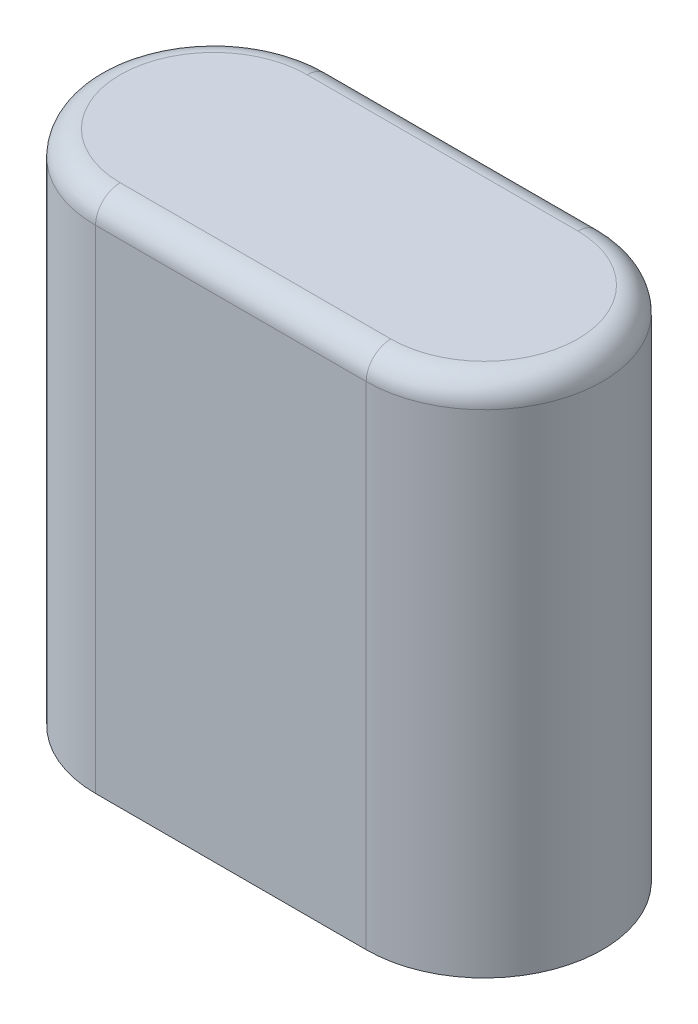
ISO-10303-21;
HEADER;
FILE_DESCRIPTION(('STEP AP214'),'2;1');
FILE_NAME('part.step','',(''),(''),'','','');
FILE_SCHEMA(('AUTOMOTIVE_DESIGN { 1 0 10303 214 1 1 1 1 }'));
ENDSEC;
DATA;
#1=APPLICATION_CONTEXT('core data for automotive mechanical design processes');
#2=APPLICATION_PROTOCOL_DEFINITION('international standard','automotive_design',2000,#1);
#3=PRODUCT_CONTEXT('',#1,'mechanical');
#4=PRODUCT('Part','Part','',(#3));
#5=PRODUCT_RELATED_PRODUCT_CATEGORY('part','',(#4));
#6=PRODUCT_DEFINITION_FORMATION('','',#4);
#7=PRODUCT_DEFINITION_CONTEXT('part definition',#1,'design');
#8=PRODUCT_DEFINITION('design','',#6,#7);
#9=PRODUCT_DEFINITION_SHAPE('','',#8);
#10=(LENGTH_UNIT() NAMED_UNIT(*) SI_UNIT(.MILLI.,.METRE.));
#11=(NAMED_UNIT(*) PLANE_ANGLE_UNIT() SI_UNIT($,.RADIAN.));
#12=(NAMED_UNIT(*) SI_UNIT($,.STERADIAN.) SOLID_ANGLE_UNIT());
#13=UNCERTAINTY_MEASURE_WITH_UNIT(LENGTH_MEASURE(1.E-05),#10,'distance_accuracy_value','');
#14=(GEOMETRIC_REPRESENTATION_CONTEXT(3) GLOBAL_UNCERTAINTY_ASSIGNED_CONTEXT((#13)) GLOBAL_UNIT_ASSIGNED_CONTEXT((#10,
#11,#12)) REPRESENTATION_CONTEXT('',''));
#15=CARTESIAN_POINT('',(0.,0.,0.));
#16=DIRECTION('',(0.,0.,1.));
#17=DIRECTION('',(1.,0.,0.));
#18=AXIS2_PLACEMENT_3D('',#15,#16,#17);
#19=CARTESIAN_POINT('',(-3.4925,13.335,0.));
#20=DIRECTION('',(0.,-1.,0.));
#21=DIRECTION('',(0.,0.,-1.));
#22=AXIS2_PLACEMENT_3D('',#19,#20,#21);
#23=CYLINDRICAL_SURFACE('',#22,3.048);
#24=DIRECTION('',(0.,-1.,0.));
#25=VECTOR('',#24,1.);
#26=CARTESIAN_POINT('',(-3.4925,13.335,3.048));
#27=LINE('',#26,#25);
#28=CARTESIAN_POINT('',(-3.4925,12.7,3.048));
#29=VERTEX_POINT('',#28);
#30=CARTESIAN_POINT('',(-3.4925,0.,3.048));
#31=VERTEX_POINT('',#30);
#32=EDGE_CURVE('E94',#29,#31,#27,.T.);
#33=ORIENTED_EDGE('',*,*,#32,.F.);
#34=CARTESIAN_POINT('',(-3.4925,12.7,0.));
#35=DIRECTION('',(0.,1.,0.));
#36=DIRECTION('',(0.,0.,1.));
#37=AXIS2_PLACEMENT_3D('',#34,#35,#36);
#38=CIRCLE('',#37,3.048);
#39=CARTESIAN_POINT('',(-3.4925,12.7,-3.048));
#40=VERTEX_POINT('',#39);
#41=EDGE_CURVE('E64',#29,#40,#38,.F.);
#42=ORIENTED_EDGE('',*,*,#41,.T.);
#43=DIRECTION('',(0.,-1.,0.));
#44=VECTOR('',#43,1.);
#45=CARTESIAN_POINT('',(-3.4925,13.335,-3.048));
#46=LINE('',#45,#44);
#47=CARTESIAN_POINT('',(-3.4925,0.,-3.048));
#48=VERTEX_POINT('',#47);
#49=EDGE_CURVE('E116',#40,#48,#46,.T.);
#50=ORIENTED_EDGE('',*,*,#49,.T.);
#51=CARTESIAN_POINT('',(-3.4925,0.,0.));
#52=DIRECTION('',(0.,1.,0.));
#53=DIRECTION('',(0.,0.,1.));
#54=AXIS2_PLACEMENT_3D('',#51,#52,#53);
#55=CIRCLE('',#54,3.048);
#56=EDGE_CURVE('E111',#48,#31,#55,.T.);
#57=ORIENTED_EDGE('',*,*,#56,.T.);
#58=EDGE_LOOP('',(#33,#42,#50,#57));
#59=FACE_BOUND('',#58,.T.);
#60=ADVANCED_FACE('F39',(#59),#23,.T.);
#61=CARTESIAN_POINT('',(-3.4925,13.335,3.048));
#62=DIRECTION('',(0.,0.,-1.));
#63=DIRECTION('',(-1.,0.,0.));
#64=AXIS2_PLACEMENT_3D('',#61,#62,#63);
#65=PLANE('',#64);
#66=DIRECTION('',(0.,-1.,0.));
#67=VECTOR('',#66,1.);
#68=CARTESIAN_POINT('',(3.4925,13.335,3.048));
#69=LINE('',#68,#67);
#70=CARTESIAN_POINT('',(3.4925,12.7,3.048));
#71=VERTEX_POINT('',#70);
#72=CARTESIAN_POINT('',(3.4925,0.,3.048));
#73=VERTEX_POINT('',#72);
#74=EDGE_CURVE('E105',#71,#73,#69,.T.);
#75=ORIENTED_EDGE('',*,*,#74,.F.);
#76=DIRECTION('',(1.,0.,0.));
#77=VECTOR('',#76,1.);
#78=CARTESIAN_POINT('',(-3.4925,12.7,3.048));
#79=LINE('',#78,#77);
#80=EDGE_CURVE('E101',#71,#29,#79,.F.);
#81=ORIENTED_EDGE('',*,*,#80,.T.);
#82=ORIENTED_EDGE('',*,*,#32,.T.);
#83=DIRECTION('',(1.,0.,0.));
#84=VECTOR('',#83,1.);
#85=CARTESIAN_POINT('',(-3.4925,0.,3.048));
#86=LINE('',#85,#84);
#87=EDGE_CURVE('E98',#31,#73,#86,.T.);
#88=ORIENTED_EDGE('',*,*,#87,.T.);
#89=EDGE_LOOP('',(#75,#81,#82,#88));
#90=FACE_BOUND('',#89,.T.);
#91=ADVANCED_FACE('F97',(#90),#65,.F.);
#92=CARTESIAN_POINT('',(3.4925,13.335,0.));
#93=DIRECTION('',(0.,-1.,0.));
#94=DIRECTION('',(0.,0.,-1.));
#95=AXIS2_PLACEMENT_3D('',#92,#93,#94);
#96=CYLINDRICAL_SURFACE('',#95,3.048);
#97=DIRECTION('',(0.,-1.,0.));
#98=VECTOR('',#97,1.);
#99=CARTESIAN_POINT('',(3.4925,13.335,-3.048));
#100=LINE('',#99,#98);
#101=CARTESIAN_POINT('',(3.4925,12.7,-3.048));
#102=VERTEX_POINT('',#101);
#103=CARTESIAN_POINT('',(3.4925,0.,-3.048));
#104=VERTEX_POINT('',#103);
#105=EDGE_CURVE('E134',#102,#104,#100,.T.);
#106=ORIENTED_EDGE('',*,*,#105,.F.);
#107=CARTESIAN_POINT('',(3.4925,12.7,0.));
#108=DIRECTION('',(0.,1.,0.));
#109=DIRECTION('',(0.,0.,1.));
#110=AXIS2_PLACEMENT_3D('',#107,#108,#109);
#111=CIRCLE('',#110,3.048);
#112=EDGE_CURVE('E11',#102,#71,#111,.F.);
#113=ORIENTED_EDGE('',*,*,#112,.T.);
#114=ORIENTED_EDGE('',*,*,#74,.T.);
#115=CARTESIAN_POINT('',(3.4925,0.,0.));
#116=DIRECTION('',(0.,1.,0.));
#117=DIRECTION('',(0.,0.,1.));
#118=AXIS2_PLACEMENT_3D('',#115,#116,#117);
#119=CIRCLE('',#118,3.048);
#120=EDGE_CURVE('E113',#73,#104,#119,.T.);
#121=ORIENTED_EDGE('',*,*,#120,.T.);
#122=EDGE_LOOP('',(#106,#113,#114,#121));
#123=FACE_BOUND('',#122,.T.);
#124=ADVANCED_FACE('F194',(#123),#96,.T.);
#125=CARTESIAN_POINT('',(-3.4925,13.335,-3.048));
#126=DIRECTION('',(0.,0.,1.));
#127=DIRECTION('',(1.,0.,0.));
#128=AXIS2_PLACEMENT_3D('',#125,#126,#127);
#129=PLANE('',#128);
#130=ORIENTED_EDGE('',*,*,#49,.F.);
#131=DIRECTION('',(-1.,0.,0.));
#132=VECTOR('',#131,1.);
#133=CARTESIAN_POINT('',(3.4925,12.7,-3.048));
#134=LINE('',#133,#132);
#135=EDGE_CURVE('E49',#40,#102,#134,.F.);
#136=ORIENTED_EDGE('',*,*,#135,.T.);
#137=ORIENTED_EDGE('',*,*,#105,.T.);
#138=DIRECTION('',(-1.,0.,0.));
#139=VECTOR('',#138,1.);
#140=CARTESIAN_POINT('',(-3.4925,0.,-3.048));
#141=LINE('',#140,#139);
#142=EDGE_CURVE('E129',#104,#48,#141,.T.);
#143=ORIENTED_EDGE('',*,*,#142,.T.);
#144=EDGE_LOOP('',(#130,#136,#137,#143));
#145=FACE_BOUND('',#144,.T.);
#146=ADVANCED_FACE('F216',(#145),#129,.F.);
#147=CARTESIAN_POINT('',(-3.4925,13.335,0.));
#148=DIRECTION('',(0.,1.,0.));
#149=DIRECTION('',(0.,0.,1.));
#150=AXIS2_PLACEMENT_3D('',#147,#148,#149);
#151=PLANE('',#150);
#152=CARTESIAN_POINT('',(-3.4925,13.335,0.));
#153=DIRECTION('',(0.,1.,0.));
#154=DIRECTION('',(0.,0.,1.));
#155=AXIS2_PLACEMENT_3D('',#152,#153,#154);
#156=CIRCLE('',#155,2.413);
#157=CARTESIAN_POINT('',(-3.4925,13.335,-2.413));
#158=VERTEX_POINT('',#157);
#159=CARTESIAN_POINT('',(-3.4925,13.335,2.413));
#160=VERTEX_POINT('',#159);
#161=EDGE_CURVE('E144',#158,#160,#156,.T.);
#162=ORIENTED_EDGE('',*,*,#161,.T.);
#163=DIRECTION('',(1.,0.,0.));
#164=VECTOR('',#163,1.);
#165=CARTESIAN_POINT('',(3.4925,13.335,2.413));
#166=LINE('',#165,#164);
#167=CARTESIAN_POINT('',(3.4925,13.335,2.413));
#168=VERTEX_POINT('',#167);
#169=EDGE_CURVE('E147',#160,#168,#166,.T.);
#170=ORIENTED_EDGE('',*,*,#169,.T.);
#171=CARTESIAN_POINT('',(3.4925,13.335,0.));
#172=DIRECTION('',(0.,1.,0.));
#173=DIRECTION('',(0.,0.,1.));
#174=AXIS2_PLACEMENT_3D('',#171,#172,#173);
#175=CIRCLE('',#174,2.413);
#176=CARTESIAN_POINT('',(3.4925,13.335,-2.413));
#177=VERTEX_POINT('',#176);
#178=EDGE_CURVE('E104',#168,#177,#175,.T.);
#179=ORIENTED_EDGE('',*,*,#178,.T.);
#180=DIRECTION('',(-1.,0.,0.));
#181=VECTOR('',#180,1.);
#182=CARTESIAN_POINT('',(-3.4925,13.335,-2.413));
#183=LINE('',#182,#181);
#184=EDGE_CURVE('E141',#177,#158,#183,.T.);
#185=ORIENTED_EDGE('',*,*,#184,.T.);
#186=EDGE_LOOP('',(#162,#170,#179,#185));
#187=FACE_BOUND('',#186,.T.);
#188=ADVANCED_FACE('F176',(#187),#151,.T.);
#189=CARTESIAN_POINT('',(-3.4925,0.,0.));
#190=DIRECTION('',(0.,1.,0.));
#191=DIRECTION('',(0.,0.,1.));
#192=AXIS2_PLACEMENT_3D('',#189,#190,#191);
#193=PLANE('',#192);
#194=CARTESIAN_POINT('',(0.,0.,0.));
#195=DIRECTION('',(0.,-1.,0.));
#196=DIRECTION('',(0.,0.,-1.));
#197=AXIS2_PLACEMENT_3D('',#194,#195,#196);
#198=CIRCLE('',#197,1.778);
#199=CARTESIAN_POINT('',(0.,0.,-1.778));
#200=VERTEX_POINT('',#199);
#201=EDGE_CURVE('E124',#200,#200,#198,.T.);
#202=ORIENTED_EDGE('',*,*,#201,.F.);
#203=EDGE_LOOP('',(#202));
#204=FACE_BOUND('',#203,.T.);
#205=ORIENTED_EDGE('',*,*,#56,.F.);
#206=ORIENTED_EDGE('',*,*,#142,.F.);
#207=ORIENTED_EDGE('',*,*,#120,.F.);
#208=ORIENTED_EDGE('',*,*,#87,.F.);
#209=EDGE_LOOP('',(#205,#206,#207,#208));
#210=FACE_BOUND('',#209,.T.);
#211=ADVANCED_FACE('F109',(#204,#210),#193,.F.);
#212=CARTESIAN_POINT('',(-3.4925,12.7,-2.413));
#213=DIRECTION('',(1.,0.,0.));
#214=DIRECTION('',(0.,0.,-1.));
#215=AXIS2_PLACEMENT_3D('',#212,#213,#214);
#216=CYLINDRICAL_SURFACE('',#215,0.635);
#217=CARTESIAN_POINT('',(3.4925,12.7,-2.413));
#218=DIRECTION('',(1.,0.,0.));
#219=DIRECTION('',(0.,0.,-1.));
#220=AXIS2_PLACEMENT_3D('',#217,#218,#219);
#221=CIRCLE('',#220,0.635);
#222=EDGE_CURVE('E122',#102,#177,#221,.T.);
#223=ORIENTED_EDGE('',*,*,#222,.F.);
#224=ORIENTED_EDGE('',*,*,#135,.F.);
#225=CARTESIAN_POINT('',(-3.4925,12.7,-2.413));
#226=DIRECTION('',(-1.,0.,0.));
#227=DIRECTION('',(0.,0.,1.));
#228=AXIS2_PLACEMENT_3D('',#225,#226,#227);
#229=CIRCLE('',#228,0.635);
#230=EDGE_CURVE('E43',#158,#40,#229,.T.);
#231=ORIENTED_EDGE('',*,*,#230,.F.);
#232=ORIENTED_EDGE('',*,*,#184,.F.);
#233=EDGE_LOOP('',(#223,#224,#231,#232));
#234=FACE_BOUND('',#233,.T.);
#235=ADVANCED_FACE('F41',(#234),#216,.T.);
#236=CARTESIAN_POINT('',(-3.4925,12.7,0.));
#237=DIRECTION('',(0.,1.,0.));
#238=DIRECTION('',(0.,0.,1.));
#239=AXIS2_PLACEMENT_3D('',#236,#237,#238);
#240=TOROIDAL_SURFACE('',#239,2.413,0.635);
#241=ORIENTED_EDGE('',*,*,#230,.T.);
#242=ORIENTED_EDGE('',*,*,#41,.F.);
#243=CARTESIAN_POINT('',(-3.4925,12.7,2.413));
#244=DIRECTION('',(1.,0.,0.));
#245=DIRECTION('',(0.,0.,-1.));
#246=AXIS2_PLACEMENT_3D('',#243,#244,#245);
#247=CIRCLE('',#246,0.635);
#248=EDGE_CURVE('E160',#160,#29,#247,.T.);
#249=ORIENTED_EDGE('',*,*,#248,.F.);
#250=ORIENTED_EDGE('',*,*,#161,.F.);
#251=EDGE_LOOP('',(#241,#242,#249,#250));
#252=FACE_BOUND('',#251,.T.);
#253=ADVANCED_FACE('F182',(#252),#240,.T.);
#254=CARTESIAN_POINT('',(3.4925,12.7,0.));
#255=DIRECTION('',(0.,1.,0.));
#256=DIRECTION('',(0.,0.,1.));
#257=AXIS2_PLACEMENT_3D('',#254,#255,#256);
#258=TOROIDAL_SURFACE('',#257,2.413,0.635);
#259=ORIENTED_EDGE('',*,*,#222,.T.);
#260=ORIENTED_EDGE('',*,*,#178,.F.);
#261=CARTESIAN_POINT('',(3.4925,12.7,2.413));
#262=DIRECTION('',(-1.,0.,0.));
#263=DIRECTION('',(0.,0.,1.));
#264=AXIS2_PLACEMENT_3D('',#261,#262,#263);
#265=CIRCLE('',#264,0.635);
#266=EDGE_CURVE('E157',#71,#168,#265,.T.);
#267=ORIENTED_EDGE('',*,*,#266,.F.);
#268=ORIENTED_EDGE('',*,*,#112,.F.);
#269=EDGE_LOOP('',(#259,#260,#267,#268));
#270=FACE_BOUND('',#269,.T.);
#271=ADVANCED_FACE('F169',(#270),#258,.T.);
#272=CARTESIAN_POINT('',(-3.4925,12.7,2.413));
#273=DIRECTION('',(-1.,0.,0.));
#274=DIRECTION('',(0.,0.,1.));
#275=AXIS2_PLACEMENT_3D('',#272,#273,#274);
#276=CYLINDRICAL_SURFACE('',#275,0.635);
#277=ORIENTED_EDGE('',*,*,#248,.T.);
#278=ORIENTED_EDGE('',*,*,#80,.F.);
#279=ORIENTED_EDGE('',*,*,#266,.T.);
#280=ORIENTED_EDGE('',*,*,#169,.F.);
#281=EDGE_LOOP('',(#277,#278,#279,#280));
#282=FACE_BOUND('',#281,.T.);
#283=ADVANCED_FACE('F180',(#282),#276,.T.);
#284=CARTESIAN_POINT('',(0.,6.985,0.));
#285=DIRECTION('',(0.,-1.,0.));
#286=DIRECTION('',(0.,0.,-1.));
#287=AXIS2_PLACEMENT_3D('',#284,#285,#286);
#288=CYLINDRICAL_SURFACE('',#287,1.778);
#289=CARTESIAN_POINT('',(0.,6.985,0.));
#290=DIRECTION('',(0.,-1.,0.));
#291=DIRECTION('',(0.,0.,-1.));
#292=AXIS2_PLACEMENT_3D('',#289,#290,#291);
#293=CIRCLE('',#292,1.778);
#294=CARTESIAN_POINT('',(0.,6.985,-1.778));
#295=VERTEX_POINT('',#294);
#296=EDGE_CURVE('E161',#295,#295,#293,.T.);
#297=ORIENTED_EDGE('',*,*,#296,.F.);
#298=EDGE_LOOP('',(#297));
#299=FACE_BOUND('',#298,.T.);
#300=ORIENTED_EDGE('',*,*,#201,.T.);
#301=EDGE_LOOP('',(#300));
#302=FACE_BOUND('',#301,.T.);
#303=ADVANCED_FACE('F199',(#299,#302),#288,.F.);
#304=CARTESIAN_POINT('',(0.,6.985,0.));
#305=DIRECTION('',(0.,-1.,0.));
#306=DIRECTION('',(0.,0.,-1.));
#307=AXIS2_PLACEMENT_3D('',#304,#305,#306);
#308=PLANE('',#307);
#309=ORIENTED_EDGE('',*,*,#296,.T.);
#310=EDGE_LOOP('',(#309));
#311=FACE_BOUND('',#310,.T.);
#312=ADVANCED_FACE('F203',(#311),#308,.T.);
#313=CLOSED_SHELL('',(#60,#91,#124,#146,#188,#211,#235,#253,#271,#283,#303,#312));
#314=MANIFOLD_SOLID_BREP('B2',#313);
#315=ADVANCED_BREP_SHAPE_REPRESENTATION('',(#18,#314),#14);
#316=SHAPE_DEFINITION_REPRESENTATION(#9,#315);
ENDSEC;
END-ISO-10303-21;
